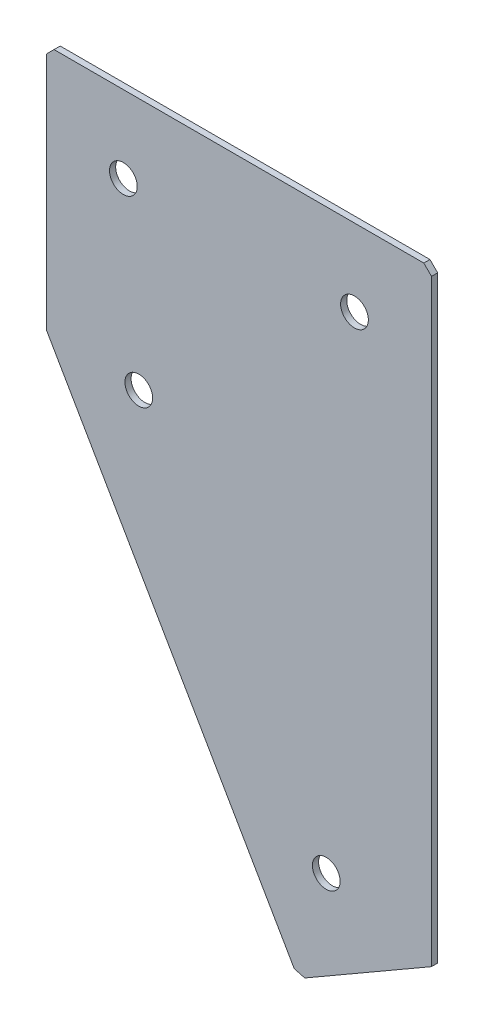
ISO-10303-21;
HEADER;
FILE_DESCRIPTION(('STEP AP214'),'2;1');
FILE_NAME('part.step','',(''),(''),'','','');
FILE_SCHEMA(('AUTOMOTIVE_DESIGN { 1 0 10303 214 1 1 1 1 }'));
ENDSEC;
DATA;
#1=APPLICATION_CONTEXT('core data for automotive mechanical design processes');
#2=APPLICATION_PROTOCOL_DEFINITION('international standard','automotive_design',2000,#1);
#3=PRODUCT_CONTEXT('',#1,'mechanical');
#4=PRODUCT('Part','Part','',(#3));
#5=PRODUCT_RELATED_PRODUCT_CATEGORY('part','',(#4));
#6=PRODUCT_DEFINITION_FORMATION('','',#4);
#7=PRODUCT_DEFINITION_CONTEXT('part definition',#1,'design');
#8=PRODUCT_DEFINITION('design','',#6,#7);
#9=PRODUCT_DEFINITION_SHAPE('','',#8);
#10=(LENGTH_UNIT() NAMED_UNIT(*) SI_UNIT(.MILLI.,.METRE.));
#11=(NAMED_UNIT(*) PLANE_ANGLE_UNIT() SI_UNIT($,.RADIAN.));
#12=(NAMED_UNIT(*) SI_UNIT($,.STERADIAN.) SOLID_ANGLE_UNIT());
#13=UNCERTAINTY_MEASURE_WITH_UNIT(LENGTH_MEASURE(1.E-05),#10,'distance_accuracy_value','');
#14=(GEOMETRIC_REPRESENTATION_CONTEXT(3) GLOBAL_UNCERTAINTY_ASSIGNED_CONTEXT((#13)) GLOBAL_UNIT_ASSIGNED_CONTEXT((#10,
#11,#12)) REPRESENTATION_CONTEXT('',''));
#15=CARTESIAN_POINT('',(0.,0.,0.));
#16=DIRECTION('',(0.,0.,1.));
#17=DIRECTION('',(1.,0.,0.));
#18=AXIS2_PLACEMENT_3D('',#15,#16,#17);
#19=CARTESIAN_POINT('',(0.,0.,-2.));
#20=DIRECTION('',(1.,0.,0.));
#21=DIRECTION('',(0.,0.,-1.));
#22=AXIS2_PLACEMENT_3D('',#19,#20,#21);
#23=PLANE('',#22);
#24=DIRECTION('',(0.,1.,0.));
#25=VECTOR('',#24,1.);
#26=CARTESIAN_POINT('',(0.,0.,0.));
#27=LINE('',#26,#25);
#28=CARTESIAN_POINT('',(0.,-80.,0.));
#29=VERTEX_POINT('',#28);
#30=CARTESIAN_POINT('',(0.,-2.49999999999997,0.));
#31=VERTEX_POINT('',#30);
#32=EDGE_CURVE('E137',#29,#31,#27,.T.);
#33=ORIENTED_EDGE('',*,*,#32,.T.);
#34=DIRECTION('',(0.,0.,-1.));
#35=VECTOR('',#34,1.);
#36=CARTESIAN_POINT('',(0.,-2.49999999999997,-2.));
#37=LINE('',#36,#35);
#38=CARTESIAN_POINT('',(0.,-2.49999999999997,-2.));
#39=VERTEX_POINT('',#38);
#40=EDGE_CURVE('E11',#31,#39,#37,.T.);
#41=ORIENTED_EDGE('',*,*,#40,.T.);
#42=DIRECTION('',(0.,1.,0.));
#43=VECTOR('',#42,1.);
#44=CARTESIAN_POINT('',(0.,0.,-2.));
#45=LINE('',#44,#43);
#46=CARTESIAN_POINT('',(0.,-80.,-2.));
#47=VERTEX_POINT('',#46);
#48=EDGE_CURVE('E153',#47,#39,#45,.T.);
#49=ORIENTED_EDGE('',*,*,#48,.F.);
#50=DIRECTION('',(0.,0.,1.));
#51=VECTOR('',#50,1.);
#52=CARTESIAN_POINT('',(0.,-80.,-2.));
#53=LINE('',#52,#51);
#54=EDGE_CURVE('E125',#47,#29,#53,.T.);
#55=ORIENTED_EDGE('',*,*,#54,.T.);
#56=EDGE_LOOP('',(#33,#41,#49,#55));
#57=FACE_BOUND('',#56,.T.);
#58=ADVANCED_FACE('F39',(#57),#23,.F.);
#59=CARTESIAN_POINT('',(0.,0.,-2.));
#60=DIRECTION('',(0.,-1.,0.));
#61=DIRECTION('',(0.,0.,-1.));
#62=AXIS2_PLACEMENT_3D('',#59,#60,#61);
#63=PLANE('',#62);
#64=DIRECTION('',(1.,0.,0.));
#65=VECTOR('',#64,1.);
#66=CARTESIAN_POINT('',(0.,0.,0.));
#67=LINE('',#66,#65);
#68=CARTESIAN_POINT('',(2.49999999999997,0.,0.));
#69=VERTEX_POINT('',#68);
#70=CARTESIAN_POINT('',(122.5,0.,0.));
#71=VERTEX_POINT('',#70);
#72=EDGE_CURVE('E141',#69,#71,#67,.T.);
#73=ORIENTED_EDGE('',*,*,#72,.T.);
#74=DIRECTION('',(0.,0.,-1.));
#75=VECTOR('',#74,1.);
#76=CARTESIAN_POINT('',(122.5,0.,-2.));
#77=LINE('',#76,#75);
#78=CARTESIAN_POINT('',(122.5,0.,-2.));
#79=VERTEX_POINT('',#78);
#80=EDGE_CURVE('E48',#71,#79,#77,.T.);
#81=ORIENTED_EDGE('',*,*,#80,.T.);
#82=DIRECTION('',(1.,0.,0.));
#83=VECTOR('',#82,1.);
#84=CARTESIAN_POINT('',(0.,0.,-2.));
#85=LINE('',#84,#83);
#86=CARTESIAN_POINT('',(2.49999999999997,0.,-2.));
#87=VERTEX_POINT('',#86);
#88=EDGE_CURVE('E113',#87,#79,#85,.T.);
#89=ORIENTED_EDGE('',*,*,#88,.F.);
#90=DIRECTION('',(0.,0.,1.));
#91=VECTOR('',#90,1.);
#92=CARTESIAN_POINT('',(2.49999999999997,0.,-2.));
#93=LINE('',#92,#91);
#94=EDGE_CURVE('E182',#87,#69,#93,.T.);
#95=ORIENTED_EDGE('',*,*,#94,.T.);
#96=EDGE_LOOP('',(#73,#81,#89,#95));
#97=FACE_BOUND('',#96,.T.);
#98=ADVANCED_FACE('F188',(#97),#63,.F.);
#99=CARTESIAN_POINT('',(125.,0.,-2.));
#100=DIRECTION('',(-1.,0.,0.));
#101=DIRECTION('',(0.,0.,1.));
#102=AXIS2_PLACEMENT_3D('',#99,#100,#101);
#103=PLANE('',#102);
#104=DIRECTION('',(0.,-1.,0.));
#105=VECTOR('',#104,1.);
#106=CARTESIAN_POINT('',(125.,0.,-2.));
#107=LINE('',#106,#105);
#108=CARTESIAN_POINT('',(125.,-2.5,-2.));
#109=VERTEX_POINT('',#108);
#110=CARTESIAN_POINT('',(125.,-196.506350946111,-2.));
#111=VERTEX_POINT('',#110);
#112=EDGE_CURVE('E103',#109,#111,#107,.T.);
#113=ORIENTED_EDGE('',*,*,#112,.F.);
#114=DIRECTION('',(0.,0.,1.));
#115=VECTOR('',#114,1.);
#116=CARTESIAN_POINT('',(125.,-2.5,-2.));
#117=LINE('',#116,#115);
#118=CARTESIAN_POINT('',(125.,-2.5,0.));
#119=VERTEX_POINT('',#118);
#120=EDGE_CURVE('E179',#109,#119,#117,.T.);
#121=ORIENTED_EDGE('',*,*,#120,.T.);
#122=DIRECTION('',(0.,-1.,0.));
#123=VECTOR('',#122,1.);
#124=CARTESIAN_POINT('',(125.,0.,0.));
#125=LINE('',#124,#123);
#126=CARTESIAN_POINT('',(125.,-196.506350946111,0.));
#127=VERTEX_POINT('',#126);
#128=EDGE_CURVE('E119',#119,#127,#125,.T.);
#129=ORIENTED_EDGE('',*,*,#128,.T.);
#130=DIRECTION('',(0.,0.,1.));
#131=VECTOR('',#130,1.);
#132=CARTESIAN_POINT('',(125.,-196.506350946111,-2.));
#133=LINE('',#132,#131);
#134=EDGE_CURVE('E116',#111,#127,#133,.T.);
#135=ORIENTED_EDGE('',*,*,#134,.F.);
#136=EDGE_LOOP('',(#113,#121,#129,#135));
#137=FACE_BOUND('',#136,.T.);
#138=ADVANCED_FACE('F117',(#137),#103,.F.);
#139=CARTESIAN_POINT('',(81.698729810778,-221.50635094611,-2.));
#140=DIRECTION('',(-0.499999999999998,0.86602540378444,0.));
#141=DIRECTION('',(-0.86602540378444,-0.499999999999998,0.));
#142=AXIS2_PLACEMENT_3D('',#139,#140,#141);
#143=PLANE('',#142);
#144=DIRECTION('',(-0.86602540378444,-0.499999999999998,0.));
#145=VECTOR('',#144,1.);
#146=CARTESIAN_POINT('',(81.698729810778,-221.50635094611,0.));
#147=LINE('',#146,#145);
#148=CARTESIAN_POINT('',(83.8637933202392,-220.25635094611,0.));
#149=VERTEX_POINT('',#148);
#150=EDGE_CURVE('E147',#127,#149,#147,.T.);
#151=ORIENTED_EDGE('',*,*,#150,.T.);
#152=DIRECTION('',(0.,0.,-1.));
#153=VECTOR('',#152,1.);
#154=CARTESIAN_POINT('',(83.8637933202392,-220.25635094611,-2.));
#155=LINE('',#154,#153);
#156=CARTESIAN_POINT('',(83.8637933202392,-220.25635094611,-2.));
#157=VERTEX_POINT('',#156);
#158=EDGE_CURVE('E129',#149,#157,#155,.T.);
#159=ORIENTED_EDGE('',*,*,#158,.T.);
#160=DIRECTION('',(-0.86602540378444,-0.499999999999998,0.));
#161=VECTOR('',#160,1.);
#162=CARTESIAN_POINT('',(81.698729810778,-221.50635094611,-2.));
#163=LINE('',#162,#161);
#164=EDGE_CURVE('E107',#111,#157,#163,.T.);
#165=ORIENTED_EDGE('',*,*,#164,.F.);
#166=ORIENTED_EDGE('',*,*,#134,.T.);
#167=EDGE_LOOP('',(#151,#159,#165,#166));
#168=FACE_BOUND('',#167,.T.);
#169=ADVANCED_FACE('F127',(#168),#143,.F.);
#170=CARTESIAN_POINT('',(0.,-80.,-2.));
#171=DIRECTION('',(0.86602540378444,0.499999999999998,0.));
#172=DIRECTION('',(-0.499999999999998,0.86602540378444,0.));
#173=AXIS2_PLACEMENT_3D('',#170,#171,#172);
#174=PLANE('',#173);
#175=DIRECTION('',(-0.499999999999998,0.86602540378444,0.));
#176=VECTOR('',#175,1.);
#177=CARTESIAN_POINT('',(0.,-80.,-2.));
#178=LINE('',#177,#176);
#179=CARTESIAN_POINT('',(80.448729810778,-219.341287436649,-2.));
#180=VERTEX_POINT('',#179);
#181=EDGE_CURVE('E131',#180,#47,#178,.T.);
#182=ORIENTED_EDGE('',*,*,#181,.F.);
#183=DIRECTION('',(0.,0.,1.));
#184=VECTOR('',#183,1.);
#185=CARTESIAN_POINT('',(80.448729810778,-219.341287436649,-2.));
#186=LINE('',#185,#184);
#187=CARTESIAN_POINT('',(80.448729810778,-219.341287436649,0.));
#188=VERTEX_POINT('',#187);
#189=EDGE_CURVE('E124',#180,#188,#186,.T.);
#190=ORIENTED_EDGE('',*,*,#189,.T.);
#191=DIRECTION('',(-0.499999999999998,0.86602540378444,0.));
#192=VECTOR('',#191,1.);
#193=CARTESIAN_POINT('',(0.,-80.,0.));
#194=LINE('',#193,#192);
#195=EDGE_CURVE('E150',#188,#29,#194,.T.);
#196=ORIENTED_EDGE('',*,*,#195,.T.);
#197=ORIENTED_EDGE('',*,*,#54,.F.);
#198=EDGE_LOOP('',(#182,#190,#196,#197));
#199=FACE_BOUND('',#198,.T.);
#200=ADVANCED_FACE('F218',(#199),#174,.F.);
#201=CARTESIAN_POINT('',(0.,0.,-2.));
#202=DIRECTION('',(0.,0.,1.));
#203=DIRECTION('',(1.,0.,0.));
#204=AXIS2_PLACEMENT_3D('',#201,#202,#203);
#205=PLANE('',#204);
#206=CARTESIAN_POINT('',(25.,-25.,-2.));
#207=DIRECTION('',(0.,0.,-1.));
#208=DIRECTION('',(0.,1.,0.));
#209=AXIS2_PLACEMENT_3D('',#206,#207,#208);
#210=CIRCLE('',#209,4.5);
#211=CARTESIAN_POINT('',(25.,-20.5,-2.));
#212=VERTEX_POINT('',#211);
#213=EDGE_CURVE('E250',#212,#212,#210,.T.);
#214=ORIENTED_EDGE('',*,*,#213,.F.);
#215=EDGE_LOOP('',(#214));
#216=FACE_BOUND('',#215,.T.);
#217=CARTESIAN_POINT('',(100.,-25.,-2.));
#218=DIRECTION('',(0.,0.,-1.));
#219=DIRECTION('',(0.,1.,0.));
#220=AXIS2_PLACEMENT_3D('',#217,#218,#219);
#221=CIRCLE('',#220,4.5);
#222=CARTESIAN_POINT('',(100.,-20.5,-2.));
#223=VERTEX_POINT('',#222);
#224=EDGE_CURVE('E254',#223,#223,#221,.T.);
#225=ORIENTED_EDGE('',*,*,#224,.F.);
#226=EDGE_LOOP('',(#225));
#227=FACE_BOUND('',#226,.T.);
#228=CARTESIAN_POINT('',(30.,-81.9615242270672,-2.00000000000001));
#229=DIRECTION('',(0.,0.,-1.));
#230=DIRECTION('',(0.,1.,0.));
#231=AXIS2_PLACEMENT_3D('',#228,#229,#230);
#232=CIRCLE('',#231,4.5);
#233=CARTESIAN_POINT('',(30.,-77.4615242270672,-2.));
#234=VERTEX_POINT('',#233);
#235=EDGE_CURVE('E264',#234,#234,#232,.T.);
#236=ORIENTED_EDGE('',*,*,#235,.F.);
#237=EDGE_LOOP('',(#236));
#238=FACE_BOUND('',#237,.T.);
#239=CARTESIAN_POINT('',(90.849364905389,-187.3557158515,-2.00000000000001));
#240=DIRECTION('',(0.,0.,-1.));
#241=DIRECTION('',(0.,1.,0.));
#242=AXIS2_PLACEMENT_3D('',#239,#240,#241);
#243=CIRCLE('',#242,4.5);
#244=CARTESIAN_POINT('',(90.849364905389,-182.8557158515,-2.00000000000001));
#245=VERTEX_POINT('',#244);
#246=EDGE_CURVE('E272',#245,#245,#243,.T.);
#247=ORIENTED_EDGE('',*,*,#246,.F.);
#248=EDGE_LOOP('',(#247));
#249=FACE_BOUND('',#248,.T.);
#250=ORIENTED_EDGE('',*,*,#164,.T.);
#251=DIRECTION('',(0.96592582628907,-0.258819045102515,0.));
#252=VECTOR('',#251,1.);
#253=CARTESIAN_POINT('',(80.448729810778,-219.341287436649,-2.));
#254=LINE('',#253,#252);
#255=EDGE_CURVE('E176',#157,#180,#254,.F.);
#256=ORIENTED_EDGE('',*,*,#255,.T.);
#257=ORIENTED_EDGE('',*,*,#181,.T.);
#258=ORIENTED_EDGE('',*,*,#48,.T.);
#259=DIRECTION('',(-0.707106781186548,-0.707106781186548,0.));
#260=VECTOR('',#259,1.);
#261=CARTESIAN_POINT('',(2.49999999999997,0.,-2.));
#262=LINE('',#261,#260);
#263=EDGE_CURVE('E171',#39,#87,#262,.F.);
#264=ORIENTED_EDGE('',*,*,#263,.T.);
#265=ORIENTED_EDGE('',*,*,#88,.T.);
#266=DIRECTION('',(-0.707106781186551,0.707106781186544,0.));
#267=VECTOR('',#266,1.);
#268=CARTESIAN_POINT('',(125.,-2.5,-2.));
#269=LINE('',#268,#267);
#270=EDGE_CURVE('E55',#79,#109,#269,.F.);
#271=ORIENTED_EDGE('',*,*,#270,.T.);
#272=ORIENTED_EDGE('',*,*,#112,.T.);
#273=EDGE_LOOP('',(#250,#256,#257,#258,#264,#265,#271,#272));
#274=FACE_BOUND('',#273,.T.);
#275=ADVANCED_FACE('F105',(#216,#227,#238,#249,#274),#205,.F.);
#276=CARTESIAN_POINT('',(0.,0.,0.));
#277=DIRECTION('',(0.,0.,1.));
#278=DIRECTION('',(1.,0.,0.));
#279=AXIS2_PLACEMENT_3D('',#276,#277,#278);
#280=PLANE('',#279);
#281=CARTESIAN_POINT('',(25.,-25.,0.));
#282=DIRECTION('',(0.,0.,-1.));
#283=DIRECTION('',(0.,1.,0.));
#284=AXIS2_PLACEMENT_3D('',#281,#282,#283);
#285=CIRCLE('',#284,4.5);
#286=CARTESIAN_POINT('',(25.,-20.5,0.));
#287=VERTEX_POINT('',#286);
#288=EDGE_CURVE('E247',#287,#287,#285,.T.);
#289=ORIENTED_EDGE('',*,*,#288,.T.);
#290=EDGE_LOOP('',(#289));
#291=FACE_BOUND('',#290,.T.);
#292=CARTESIAN_POINT('',(100.,-25.,0.));
#293=DIRECTION('',(0.,0.,-1.));
#294=DIRECTION('',(0.,1.,0.));
#295=AXIS2_PLACEMENT_3D('',#292,#293,#294);
#296=CIRCLE('',#295,4.5);
#297=CARTESIAN_POINT('',(100.,-20.5,0.));
#298=VERTEX_POINT('',#297);
#299=EDGE_CURVE('E260',#298,#298,#296,.T.);
#300=ORIENTED_EDGE('',*,*,#299,.T.);
#301=EDGE_LOOP('',(#300));
#302=FACE_BOUND('',#301,.T.);
#303=CARTESIAN_POINT('',(30.,-81.9615242270672,0.));
#304=DIRECTION('',(0.,0.,-1.));
#305=DIRECTION('',(0.,1.,0.));
#306=AXIS2_PLACEMENT_3D('',#303,#304,#305);
#307=CIRCLE('',#306,4.5);
#308=CARTESIAN_POINT('',(30.,-77.4615242270672,0.));
#309=VERTEX_POINT('',#308);
#310=EDGE_CURVE('E268',#309,#309,#307,.T.);
#311=ORIENTED_EDGE('',*,*,#310,.T.);
#312=EDGE_LOOP('',(#311));
#313=FACE_BOUND('',#312,.T.);
#314=CARTESIAN_POINT('',(90.849364905389,-187.3557158515,0.));
#315=DIRECTION('',(0.,0.,-1.));
#316=DIRECTION('',(0.,1.,0.));
#317=AXIS2_PLACEMENT_3D('',#314,#315,#316);
#318=CIRCLE('',#317,4.5);
#319=CARTESIAN_POINT('',(90.849364905389,-182.8557158515,0.));
#320=VERTEX_POINT('',#319);
#321=EDGE_CURVE('E142',#320,#320,#318,.T.);
#322=ORIENTED_EDGE('',*,*,#321,.T.);
#323=EDGE_LOOP('',(#322));
#324=FACE_BOUND('',#323,.T.);
#325=ORIENTED_EDGE('',*,*,#195,.F.);
#326=DIRECTION('',(-0.96592582628907,0.258819045102515,0.));
#327=VECTOR('',#326,1.);
#328=CARTESIAN_POINT('',(-49.4462788129345,-184.536024775093,0.));
#329=LINE('',#328,#327);
#330=EDGE_CURVE('E166',#188,#149,#329,.F.);
#331=ORIENTED_EDGE('',*,*,#330,.T.);
#332=ORIENTED_EDGE('',*,*,#150,.F.);
#333=ORIENTED_EDGE('',*,*,#128,.F.);
#334=DIRECTION('',(0.707106781186551,-0.707106781186544,0.));
#335=VECTOR('',#334,1.);
#336=CARTESIAN_POINT('',(61.2499999999993,61.25,0.));
#337=LINE('',#336,#335);
#338=EDGE_CURVE('E163',#119,#71,#337,.F.);
#339=ORIENTED_EDGE('',*,*,#338,.T.);
#340=ORIENTED_EDGE('',*,*,#72,.F.);
#341=DIRECTION('',(0.707106781186548,0.707106781186548,0.));
#342=VECTOR('',#341,1.);
#343=CARTESIAN_POINT('',(1.24999999999999,-1.24999999999999,0.));
#344=LINE('',#343,#342);
#345=EDGE_CURVE('E160',#69,#31,#344,.F.);
#346=ORIENTED_EDGE('',*,*,#345,.T.);
#347=ORIENTED_EDGE('',*,*,#32,.F.);
#348=EDGE_LOOP('',(#325,#331,#332,#333,#339,#340,#346,#347));
#349=FACE_BOUND('',#348,.T.);
#350=ADVANCED_FACE('F193',(#291,#302,#313,#324,#349),#280,.T.);
#351=CARTESIAN_POINT('',(90.849364905389,-187.3557158515,-2.00000000000001));
#352=DIRECTION('',(0.,0.,-1.));
#353=DIRECTION('',(0.,1.,0.));
#354=AXIS2_PLACEMENT_3D('',#351,#352,#353);
#355=CYLINDRICAL_SURFACE('',#354,4.5);
#356=ORIENTED_EDGE('',*,*,#321,.F.);
#357=EDGE_LOOP('',(#356));
#358=FACE_BOUND('',#357,.T.);
#359=ORIENTED_EDGE('',*,*,#246,.T.);
#360=EDGE_LOOP('',(#359));
#361=FACE_BOUND('',#360,.T.);
#362=ADVANCED_FACE('F224',(#358,#361),#355,.F.);
#363=CARTESIAN_POINT('',(30.,-81.9615242270672,-2.00000000000001));
#364=DIRECTION('',(0.,0.,-1.));
#365=DIRECTION('',(0.,1.,0.));
#366=AXIS2_PLACEMENT_3D('',#363,#364,#365);
#367=CYLINDRICAL_SURFACE('',#366,4.5);
#368=ORIENTED_EDGE('',*,*,#310,.F.);
#369=EDGE_LOOP('',(#368));
#370=FACE_BOUND('',#369,.T.);
#371=ORIENTED_EDGE('',*,*,#235,.T.);
#372=EDGE_LOOP('',(#371));
#373=FACE_BOUND('',#372,.T.);
#374=ADVANCED_FACE('F231',(#370,#373),#367,.F.);
#375=CARTESIAN_POINT('',(100.,-25.,-2.));
#376=DIRECTION('',(0.,0.,-1.));
#377=DIRECTION('',(0.,1.,0.));
#378=AXIS2_PLACEMENT_3D('',#375,#376,#377);
#379=CYLINDRICAL_SURFACE('',#378,4.5);
#380=ORIENTED_EDGE('',*,*,#299,.F.);
#381=EDGE_LOOP('',(#380));
#382=FACE_BOUND('',#381,.T.);
#383=ORIENTED_EDGE('',*,*,#224,.T.);
#384=EDGE_LOOP('',(#383));
#385=FACE_BOUND('',#384,.T.);
#386=ADVANCED_FACE('F235',(#382,#385),#379,.F.);
#387=CARTESIAN_POINT('',(25.,-25.,-2.));
#388=DIRECTION('',(0.,0.,-1.));
#389=DIRECTION('',(0.,1.,0.));
#390=AXIS2_PLACEMENT_3D('',#387,#388,#389);
#391=CYLINDRICAL_SURFACE('',#390,4.5);
#392=ORIENTED_EDGE('',*,*,#288,.F.);
#393=EDGE_LOOP('',(#392));
#394=FACE_BOUND('',#393,.T.);
#395=ORIENTED_EDGE('',*,*,#213,.T.);
#396=EDGE_LOOP('',(#395));
#397=FACE_BOUND('',#396,.T.);
#398=ADVANCED_FACE('F203',(#394,#397),#391,.F.);
#399=CARTESIAN_POINT('',(80.448729810778,-219.341287436649,-2.));
#400=DIRECTION('',(0.258819045102515,0.96592582628907,0.));
#401=DIRECTION('',(0.,0.,1.));
#402=AXIS2_PLACEMENT_3D('',#399,#400,#401);
#403=PLANE('',#402);
#404=ORIENTED_EDGE('',*,*,#255,.F.);
#405=ORIENTED_EDGE('',*,*,#158,.F.);
#406=ORIENTED_EDGE('',*,*,#330,.F.);
#407=ORIENTED_EDGE('',*,*,#189,.F.);
#408=EDGE_LOOP('',(#404,#405,#406,#407));
#409=FACE_BOUND('',#408,.T.);
#410=ADVANCED_FACE('F198',(#409),#403,.F.);
#411=CARTESIAN_POINT('',(125.,-2.5,-2.));
#412=DIRECTION('',(-0.707106781186543,-0.707106781186551,0.));
#413=DIRECTION('',(0.,0.,1.));
#414=AXIS2_PLACEMENT_3D('',#411,#412,#413);
#415=PLANE('',#414);
#416=ORIENTED_EDGE('',*,*,#270,.F.);
#417=ORIENTED_EDGE('',*,*,#80,.F.);
#418=ORIENTED_EDGE('',*,*,#338,.F.);
#419=ORIENTED_EDGE('',*,*,#120,.F.);
#420=EDGE_LOOP('',(#416,#417,#418,#419));
#421=FACE_BOUND('',#420,.T.);
#422=ADVANCED_FACE('F196',(#421),#415,.F.);
#423=CARTESIAN_POINT('',(2.49999999999997,0.,-2.));
#424=DIRECTION('',(0.707106781186547,-0.707106781186547,0.));
#425=DIRECTION('',(0.,0.,1.));
#426=AXIS2_PLACEMENT_3D('',#423,#424,#425);
#427=PLANE('',#426);
#428=ORIENTED_EDGE('',*,*,#263,.F.);
#429=ORIENTED_EDGE('',*,*,#40,.F.);
#430=ORIENTED_EDGE('',*,*,#345,.F.);
#431=ORIENTED_EDGE('',*,*,#94,.F.);
#432=EDGE_LOOP('',(#428,#429,#430,#431));
#433=FACE_BOUND('',#432,.T.);
#434=ADVANCED_FACE('F41',(#433),#427,.F.);
#435=CLOSED_SHELL('',(#58,#98,#138,#169,#200,#275,#350,#362,#374,#386,#398,#410,#422,#434));
#436=MANIFOLD_SOLID_BREP('B2',#435);
#437=ADVANCED_BREP_SHAPE_REPRESENTATION('',(#18,#436),#14);
#438=SHAPE_DEFINITION_REPRESENTATION(#9,#437);
ENDSEC;
END-ISO-10303-21;
